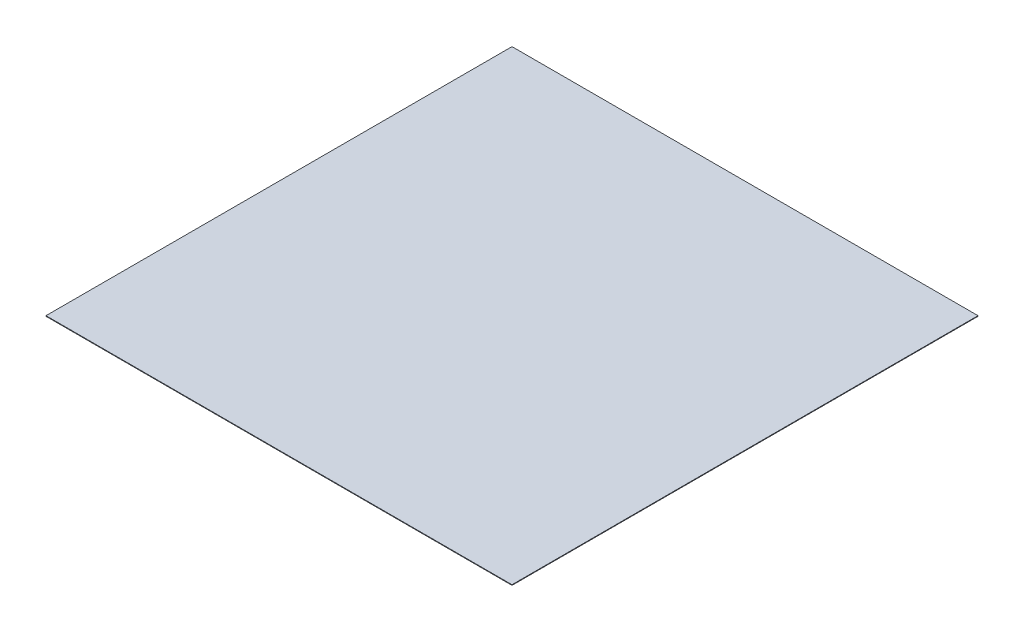
ISO-10303-21;
HEADER;
FILE_DESCRIPTION(('STEP AP214'),'2;1');
FILE_NAME('part.step','',(''),(''),'','','');
FILE_SCHEMA(('AUTOMOTIVE_DESIGN { 1 0 10303 214 1 1 1 1 }'));
ENDSEC;
DATA;
#1=APPLICATION_CONTEXT('core data for automotive mechanical design processes');
#2=APPLICATION_PROTOCOL_DEFINITION('international standard','automotive_design',2000,#1);
#3=PRODUCT_CONTEXT('',#1,'mechanical');
#4=PRODUCT('Part','Part','',(#3));
#5=PRODUCT_RELATED_PRODUCT_CATEGORY('part','',(#4));
#6=PRODUCT_DEFINITION_FORMATION('','',#4);
#7=PRODUCT_DEFINITION_CONTEXT('part definition',#1,'design');
#8=PRODUCT_DEFINITION('design','',#6,#7);
#9=PRODUCT_DEFINITION_SHAPE('','',#8);
#10=(LENGTH_UNIT() NAMED_UNIT(*) SI_UNIT(.MILLI.,.METRE.));
#11=(NAMED_UNIT(*) PLANE_ANGLE_UNIT() SI_UNIT($,.RADIAN.));
#12=(NAMED_UNIT(*) SI_UNIT($,.STERADIAN.) SOLID_ANGLE_UNIT());
#13=UNCERTAINTY_MEASURE_WITH_UNIT(LENGTH_MEASURE(1.E-05),#10,'distance_accuracy_value','');
#14=(GEOMETRIC_REPRESENTATION_CONTEXT(3) GLOBAL_UNCERTAINTY_ASSIGNED_CONTEXT((#13)) GLOBAL_UNIT_ASSIGNED_CONTEXT((#10,
#11,#12)) REPRESENTATION_CONTEXT('',''));
#15=CARTESIAN_POINT('',(0.,0.,0.));
#16=DIRECTION('',(0.,0.,1.));
#17=DIRECTION('',(1.,0.,0.));
#18=AXIS2_PLACEMENT_3D('',#15,#16,#17);
#19=CARTESIAN_POINT('',(-43023.6220472441,50.,-47496.062992126));
#20=DIRECTION('',(1.,0.,0.));
#21=DIRECTION('',(0.,0.,-1.));
#22=AXIS2_PLACEMENT_3D('',#19,#20,#21);
#23=PLANE('',#22);
#24=DIRECTION('',(0.,0.,1.));
#25=VECTOR('',#24,1.);
#26=CARTESIAN_POINT('',(-43023.6220472441,-50.,-47496.062992126));
#27=LINE('',#26,#25);
#28=CARTESIAN_POINT('',(-43023.6220472441,-50.,-47496.062992126));
#29=VERTEX_POINT('',#28);
#30=CARTESIAN_POINT('',(-43023.6220472441,-50.,32503.937007874));
#31=VERTEX_POINT('',#30);
#32=EDGE_CURVE('E104',#29,#31,#27,.T.);
#33=ORIENTED_EDGE('',*,*,#32,.T.);
#34=DIRECTION('',(0.,-1.,0.));
#35=VECTOR('',#34,1.);
#36=CARTESIAN_POINT('',(-43023.6220472441,50.,32503.937007874));
#37=LINE('',#36,#35);
#38=CARTESIAN_POINT('',(-43023.6220472441,50.,32503.937007874));
#39=VERTEX_POINT('',#38);
#40=EDGE_CURVE('E11',#39,#31,#37,.T.);
#41=ORIENTED_EDGE('',*,*,#40,.F.);
#42=DIRECTION('',(0.,0.,1.));
#43=VECTOR('',#42,1.);
#44=CARTESIAN_POINT('',(-43023.6220472441,50.,-47496.062992126));
#45=LINE('',#44,#43);
#46=CARTESIAN_POINT('',(-43023.6220472441,50.,-47496.062992126));
#47=VERTEX_POINT('',#46);
#48=EDGE_CURVE('E92',#47,#39,#45,.T.);
#49=ORIENTED_EDGE('',*,*,#48,.F.);
#50=DIRECTION('',(0.,-1.,0.));
#51=VECTOR('',#50,1.);
#52=CARTESIAN_POINT('',(-43023.6220472441,50.,-47496.062992126));
#53=LINE('',#52,#51);
#54=EDGE_CURVE('E100',#47,#29,#53,.T.);
#55=ORIENTED_EDGE('',*,*,#54,.T.);
#56=EDGE_LOOP('',(#33,#41,#49,#55));
#57=FACE_BOUND('',#56,.T.);
#58=ADVANCED_FACE('F41',(#57),#23,.F.);
#59=CARTESIAN_POINT('',(-43023.6220472441,50.,32503.937007874));
#60=DIRECTION('',(0.,0.,-1.));
#61=DIRECTION('',(-1.,0.,0.));
#62=AXIS2_PLACEMENT_3D('',#59,#60,#61);
#63=PLANE('',#62);
#64=DIRECTION('',(1.,0.,0.));
#65=VECTOR('',#64,1.);
#66=CARTESIAN_POINT('',(-43023.6220472441,-50.,32503.937007874));
#67=LINE('',#66,#65);
#68=CARTESIAN_POINT('',(36976.3779527559,-50.,32503.937007874));
#69=VERTEX_POINT('',#68);
#70=EDGE_CURVE('E96',#31,#69,#67,.T.);
#71=ORIENTED_EDGE('',*,*,#70,.T.);
#72=DIRECTION('',(0.,-1.,0.));
#73=VECTOR('',#72,1.);
#74=CARTESIAN_POINT('',(36976.3779527559,50.,32503.937007874));
#75=LINE('',#74,#73);
#76=CARTESIAN_POINT('',(36976.3779527559,50.,32503.937007874));
#77=VERTEX_POINT('',#76);
#78=EDGE_CURVE('E49',#77,#69,#75,.T.);
#79=ORIENTED_EDGE('',*,*,#78,.F.);
#80=DIRECTION('',(1.,0.,0.));
#81=VECTOR('',#80,1.);
#82=CARTESIAN_POINT('',(-43023.6220472441,50.,32503.937007874));
#83=LINE('',#82,#81);
#84=EDGE_CURVE('E87',#39,#77,#83,.T.);
#85=ORIENTED_EDGE('',*,*,#84,.F.);
#86=ORIENTED_EDGE('',*,*,#40,.T.);
#87=EDGE_LOOP('',(#71,#79,#85,#86));
#88=FACE_BOUND('',#87,.T.);
#89=ADVANCED_FACE('F95',(#88),#63,.F.);
#90=CARTESIAN_POINT('',(36976.3779527559,50.,-47496.062992126));
#91=DIRECTION('',(-1.,0.,0.));
#92=DIRECTION('',(0.,0.,1.));
#93=AXIS2_PLACEMENT_3D('',#90,#91,#92);
#94=PLANE('',#93);
#95=DIRECTION('',(0.,0.,-1.));
#96=VECTOR('',#95,1.);
#97=CARTESIAN_POINT('',(36976.3779527559,-50.,-47496.062992126));
#98=LINE('',#97,#96);
#99=CARTESIAN_POINT('',(36976.3779527559,-50.,-47496.062992126));
#100=VERTEX_POINT('',#99);
#101=EDGE_CURVE('E74',#69,#100,#98,.T.);
#102=ORIENTED_EDGE('',*,*,#101,.T.);
#103=DIRECTION('',(0.,-1.,0.));
#104=VECTOR('',#103,1.);
#105=CARTESIAN_POINT('',(36976.3779527559,50.,-47496.062992126));
#106=LINE('',#105,#104);
#107=CARTESIAN_POINT('',(36976.3779527559,50.,-47496.062992126));
#108=VERTEX_POINT('',#107);
#109=EDGE_CURVE('E97',#108,#100,#106,.T.);
#110=ORIENTED_EDGE('',*,*,#109,.F.);
#111=DIRECTION('',(0.,0.,-1.));
#112=VECTOR('',#111,1.);
#113=CARTESIAN_POINT('',(36976.3779527559,50.,-47496.062992126));
#114=LINE('',#113,#112);
#115=EDGE_CURVE('E90',#77,#108,#114,.T.);
#116=ORIENTED_EDGE('',*,*,#115,.F.);
#117=ORIENTED_EDGE('',*,*,#78,.T.);
#118=EDGE_LOOP('',(#102,#110,#116,#117));
#119=FACE_BOUND('',#118,.T.);
#120=ADVANCED_FACE('F98',(#119),#94,.F.);
#121=CARTESIAN_POINT('',(-43023.6220472441,50.,-47496.062992126));
#122=DIRECTION('',(0.,0.,1.));
#123=DIRECTION('',(1.,0.,0.));
#124=AXIS2_PLACEMENT_3D('',#121,#122,#123);
#125=PLANE('',#124);
#126=DIRECTION('',(-1.,0.,0.));
#127=VECTOR('',#126,1.);
#128=CARTESIAN_POINT('',(-43023.6220472441,-50.,-47496.062992126));
#129=LINE('',#128,#127);
#130=EDGE_CURVE('E80',#100,#29,#129,.T.);
#131=ORIENTED_EDGE('',*,*,#130,.T.);
#132=ORIENTED_EDGE('',*,*,#54,.F.);
#133=DIRECTION('',(-1.,0.,0.));
#134=VECTOR('',#133,1.);
#135=CARTESIAN_POINT('',(-43023.6220472441,50.,-47496.062992126));
#136=LINE('',#135,#134);
#137=EDGE_CURVE('E57',#108,#47,#136,.T.);
#138=ORIENTED_EDGE('',*,*,#137,.F.);
#139=ORIENTED_EDGE('',*,*,#109,.T.);
#140=EDGE_LOOP('',(#131,#132,#138,#139));
#141=FACE_BOUND('',#140,.T.);
#142=ADVANCED_FACE('F111',(#141),#125,.F.);
#143=CARTESIAN_POINT('',(0.,50.,0.));
#144=DIRECTION('',(0.,1.,0.));
#145=DIRECTION('',(0.,0.,1.));
#146=AXIS2_PLACEMENT_3D('',#143,#144,#145);
#147=PLANE('',#146);
#148=ORIENTED_EDGE('',*,*,#48,.T.);
#149=ORIENTED_EDGE('',*,*,#84,.T.);
#150=ORIENTED_EDGE('',*,*,#115,.T.);
#151=ORIENTED_EDGE('',*,*,#137,.T.);
#152=EDGE_LOOP('',(#148,#149,#150,#151));
#153=FACE_BOUND('',#152,.T.);
#154=ADVANCED_FACE('F88',(#153),#147,.T.);
#155=CARTESIAN_POINT('',(0.,-50.,0.));
#156=DIRECTION('',(0.,1.,0.));
#157=DIRECTION('',(0.,0.,1.));
#158=AXIS2_PLACEMENT_3D('',#155,#156,#157);
#159=PLANE('',#158);
#160=ORIENTED_EDGE('',*,*,#32,.F.);
#161=ORIENTED_EDGE('',*,*,#130,.F.);
#162=ORIENTED_EDGE('',*,*,#101,.F.);
#163=ORIENTED_EDGE('',*,*,#70,.F.);
#164=EDGE_LOOP('',(#160,#161,#162,#163));
#165=FACE_BOUND('',#164,.T.);
#166=ADVANCED_FACE('F114',(#165),#159,.F.);
#167=CLOSED_SHELL('',(#58,#89,#120,#142,#154,#166));
#168=MANIFOLD_SOLID_BREP('B2',#167);
#169=ADVANCED_BREP_SHAPE_REPRESENTATION('',(#18,#168),#14);
#170=SHAPE_DEFINITION_REPRESENTATION(#9,#169);
ENDSEC;
END-ISO-10303-21;
